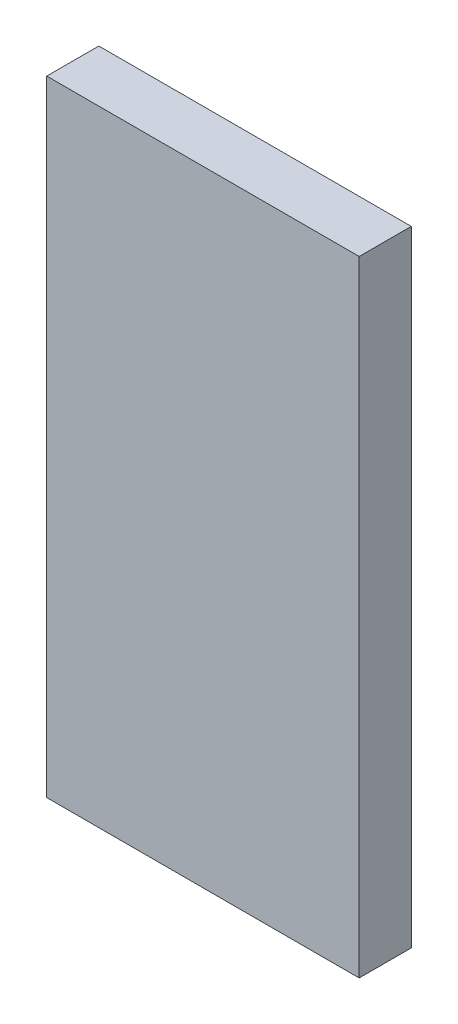
ISO-10303-21;
HEADER;
FILE_DESCRIPTION(('STEP AP214'),'2;1');
FILE_NAME('part.step','',(''),(''),'','','');
FILE_SCHEMA(('AUTOMOTIVE_DESIGN { 1 0 10303 214 1 1 1 1 }'));
ENDSEC;
DATA;
#1=APPLICATION_CONTEXT('core data for automotive mechanical design processes');
#2=APPLICATION_PROTOCOL_DEFINITION('international standard','automotive_design',2000,#1);
#3=PRODUCT_CONTEXT('',#1,'mechanical');
#4=PRODUCT('Part','Part','',(#3));
#5=PRODUCT_RELATED_PRODUCT_CATEGORY('part','',(#4));
#6=PRODUCT_DEFINITION_FORMATION('','',#4);
#7=PRODUCT_DEFINITION_CONTEXT('part definition',#1,'design');
#8=PRODUCT_DEFINITION('design','',#6,#7);
#9=PRODUCT_DEFINITION_SHAPE('','',#8);
#10=(LENGTH_UNIT() NAMED_UNIT(*) SI_UNIT(.MILLI.,.METRE.));
#11=(NAMED_UNIT(*) PLANE_ANGLE_UNIT() SI_UNIT($,.RADIAN.));
#12=(NAMED_UNIT(*) SI_UNIT($,.STERADIAN.) SOLID_ANGLE_UNIT());
#13=UNCERTAINTY_MEASURE_WITH_UNIT(LENGTH_MEASURE(1.E-05),#10,'distance_accuracy_value','');
#14=(GEOMETRIC_REPRESENTATION_CONTEXT(3) GLOBAL_UNCERTAINTY_ASSIGNED_CONTEXT((#13)) GLOBAL_UNIT_ASSIGNED_CONTEXT((#10,
#11,#12)) REPRESENTATION_CONTEXT('',''));
#15=CARTESIAN_POINT('',(0.,0.,0.));
#16=DIRECTION('',(0.,0.,1.));
#17=DIRECTION('',(1.,0.,0.));
#18=AXIS2_PLACEMENT_3D('',#15,#16,#17);
#19=CARTESIAN_POINT('',(19.05,-38.1,6.35));
#20=DIRECTION('',(-1.,0.,0.));
#21=DIRECTION('',(0.,0.,1.));
#22=AXIS2_PLACEMENT_3D('',#19,#20,#21);
#23=PLANE('',#22);
#24=DIRECTION('',(0.,1.,0.));
#25=VECTOR('',#24,1.);
#26=CARTESIAN_POINT('',(19.05,-38.1,0.));
#27=LINE('',#26,#25);
#28=CARTESIAN_POINT('',(19.05,-38.1,0.));
#29=VERTEX_POINT('',#28);
#30=CARTESIAN_POINT('',(19.05,38.1,0.));
#31=VERTEX_POINT('',#30);
#32=EDGE_CURVE('E107',#29,#31,#27,.T.);
#33=ORIENTED_EDGE('',*,*,#32,.T.);
#34=DIRECTION('',(0.,0.,-1.));
#35=VECTOR('',#34,1.);
#36=CARTESIAN_POINT('',(19.05,38.1,6.35));
#37=LINE('',#36,#35);
#38=CARTESIAN_POINT('',(19.05,38.1,6.35));
#39=VERTEX_POINT('',#38);
#40=EDGE_CURVE('E11',#39,#31,#37,.T.);
#41=ORIENTED_EDGE('',*,*,#40,.F.);
#42=DIRECTION('',(0.,1.,0.));
#43=VECTOR('',#42,1.);
#44=CARTESIAN_POINT('',(19.05,-38.1,6.35));
#45=LINE('',#44,#43);
#46=CARTESIAN_POINT('',(19.05,-38.1,6.35));
#47=VERTEX_POINT('',#46);
#48=EDGE_CURVE('E91',#47,#39,#45,.T.);
#49=ORIENTED_EDGE('',*,*,#48,.F.);
#50=DIRECTION('',(0.,0.,-1.));
#51=VECTOR('',#50,1.);
#52=CARTESIAN_POINT('',(19.05,-38.1,6.35));
#53=LINE('',#52,#51);
#54=EDGE_CURVE('E103',#47,#29,#53,.T.);
#55=ORIENTED_EDGE('',*,*,#54,.T.);
#56=EDGE_LOOP('',(#33,#41,#49,#55));
#57=FACE_BOUND('',#56,.T.);
#58=ADVANCED_FACE('F39',(#57),#23,.F.);
#59=CARTESIAN_POINT('',(-19.05,38.1,6.35));
#60=DIRECTION('',(0.,-1.,0.));
#61=DIRECTION('',(0.,0.,-1.));
#62=AXIS2_PLACEMENT_3D('',#59,#60,#61);
#63=PLANE('',#62);
#64=DIRECTION('',(-1.,0.,0.));
#65=VECTOR('',#64,1.);
#66=CARTESIAN_POINT('',(-19.05,38.1,0.));
#67=LINE('',#66,#65);
#68=CARTESIAN_POINT('',(-19.05,38.1,0.));
#69=VERTEX_POINT('',#68);
#70=EDGE_CURVE('E96',#31,#69,#67,.T.);
#71=ORIENTED_EDGE('',*,*,#70,.T.);
#72=DIRECTION('',(0.,0.,-1.));
#73=VECTOR('',#72,1.);
#74=CARTESIAN_POINT('',(-19.05,38.1,6.35));
#75=LINE('',#74,#73);
#76=CARTESIAN_POINT('',(-19.05,38.1,6.35));
#77=VERTEX_POINT('',#76);
#78=EDGE_CURVE('E48',#77,#69,#75,.T.);
#79=ORIENTED_EDGE('',*,*,#78,.F.);
#80=DIRECTION('',(-1.,0.,0.));
#81=VECTOR('',#80,1.);
#82=CARTESIAN_POINT('',(-19.05,38.1,6.35));
#83=LINE('',#82,#81);
#84=EDGE_CURVE('E86',#39,#77,#83,.T.);
#85=ORIENTED_EDGE('',*,*,#84,.F.);
#86=ORIENTED_EDGE('',*,*,#40,.T.);
#87=EDGE_LOOP('',(#71,#79,#85,#86));
#88=FACE_BOUND('',#87,.T.);
#89=ADVANCED_FACE('F95',(#88),#63,.F.);
#90=CARTESIAN_POINT('',(-19.05,-38.1,6.35));
#91=DIRECTION('',(1.,0.,0.));
#92=DIRECTION('',(0.,0.,-1.));
#93=AXIS2_PLACEMENT_3D('',#90,#91,#92);
#94=PLANE('',#93);
#95=DIRECTION('',(0.,-1.,0.));
#96=VECTOR('',#95,1.);
#97=CARTESIAN_POINT('',(-19.05,-38.1,0.));
#98=LINE('',#97,#96);
#99=CARTESIAN_POINT('',(-19.05,-38.1,0.));
#100=VERTEX_POINT('',#99);
#101=EDGE_CURVE('E73',#69,#100,#98,.T.);
#102=ORIENTED_EDGE('',*,*,#101,.T.);
#103=DIRECTION('',(0.,0.,-1.));
#104=VECTOR('',#103,1.);
#105=CARTESIAN_POINT('',(-19.05,-38.1,6.35));
#106=LINE('',#105,#104);
#107=CARTESIAN_POINT('',(-19.05,-38.1,6.35));
#108=VERTEX_POINT('',#107);
#109=EDGE_CURVE('E98',#108,#100,#106,.T.);
#110=ORIENTED_EDGE('',*,*,#109,.F.);
#111=DIRECTION('',(0.,-1.,0.));
#112=VECTOR('',#111,1.);
#113=CARTESIAN_POINT('',(-19.05,-38.1,6.35));
#114=LINE('',#113,#112);
#115=EDGE_CURVE('E89',#77,#108,#114,.T.);
#116=ORIENTED_EDGE('',*,*,#115,.F.);
#117=ORIENTED_EDGE('',*,*,#78,.T.);
#118=EDGE_LOOP('',(#102,#110,#116,#117));
#119=FACE_BOUND('',#118,.T.);
#120=ADVANCED_FACE('F99',(#119),#94,.F.);
#121=CARTESIAN_POINT('',(-19.05,-38.1,6.35));
#122=DIRECTION('',(0.,1.,0.));
#123=DIRECTION('',(0.,0.,1.));
#124=AXIS2_PLACEMENT_3D('',#121,#122,#123);
#125=PLANE('',#124);
#126=DIRECTION('',(1.,0.,0.));
#127=VECTOR('',#126,1.);
#128=CARTESIAN_POINT('',(-19.05,-38.1,0.));
#129=LINE('',#128,#127);
#130=EDGE_CURVE('E79',#100,#29,#129,.T.);
#131=ORIENTED_EDGE('',*,*,#130,.T.);
#132=ORIENTED_EDGE('',*,*,#54,.F.);
#133=DIRECTION('',(1.,0.,0.));
#134=VECTOR('',#133,1.);
#135=CARTESIAN_POINT('',(-19.05,-38.1,6.35));
#136=LINE('',#135,#134);
#137=EDGE_CURVE('E56',#108,#47,#136,.T.);
#138=ORIENTED_EDGE('',*,*,#137,.F.);
#139=ORIENTED_EDGE('',*,*,#109,.T.);
#140=EDGE_LOOP('',(#131,#132,#138,#139));
#141=FACE_BOUND('',#140,.T.);
#142=ADVANCED_FACE('F120',(#141),#125,.F.);
#143=CARTESIAN_POINT('',(0.,0.,6.35));
#144=DIRECTION('',(0.,0.,-1.));
#145=DIRECTION('',(-1.,0.,0.));
#146=AXIS2_PLACEMENT_3D('',#143,#144,#145);
#147=PLANE('',#146);
#148=ORIENTED_EDGE('',*,*,#48,.T.);
#149=ORIENTED_EDGE('',*,*,#84,.T.);
#150=ORIENTED_EDGE('',*,*,#115,.T.);
#151=ORIENTED_EDGE('',*,*,#137,.T.);
#152=EDGE_LOOP('',(#148,#149,#150,#151));
#153=FACE_BOUND('',#152,.T.);
#154=ADVANCED_FACE('F87',(#153),#147,.F.);
#155=CARTESIAN_POINT('',(0.,0.,0.));
#156=DIRECTION('',(0.,0.,-1.));
#157=DIRECTION('',(-1.,0.,0.));
#158=AXIS2_PLACEMENT_3D('',#155,#156,#157);
#159=PLANE('',#158);
#160=ORIENTED_EDGE('',*,*,#32,.F.);
#161=ORIENTED_EDGE('',*,*,#130,.F.);
#162=ORIENTED_EDGE('',*,*,#101,.F.);
#163=ORIENTED_EDGE('',*,*,#70,.F.);
#164=EDGE_LOOP('',(#160,#161,#162,#163));
#165=FACE_BOUND('',#164,.T.);
#166=ADVANCED_FACE('F123',(#165),#159,.T.);
#167=CLOSED_SHELL('',(#58,#89,#120,#142,#154,#166));
#168=MANIFOLD_SOLID_BREP('B2',#167);
#169=ADVANCED_BREP_SHAPE_REPRESENTATION('',(#18,#168),#14);
#170=SHAPE_DEFINITION_REPRESENTATION(#9,#169);
ENDSEC;
END-ISO-10303-21;
